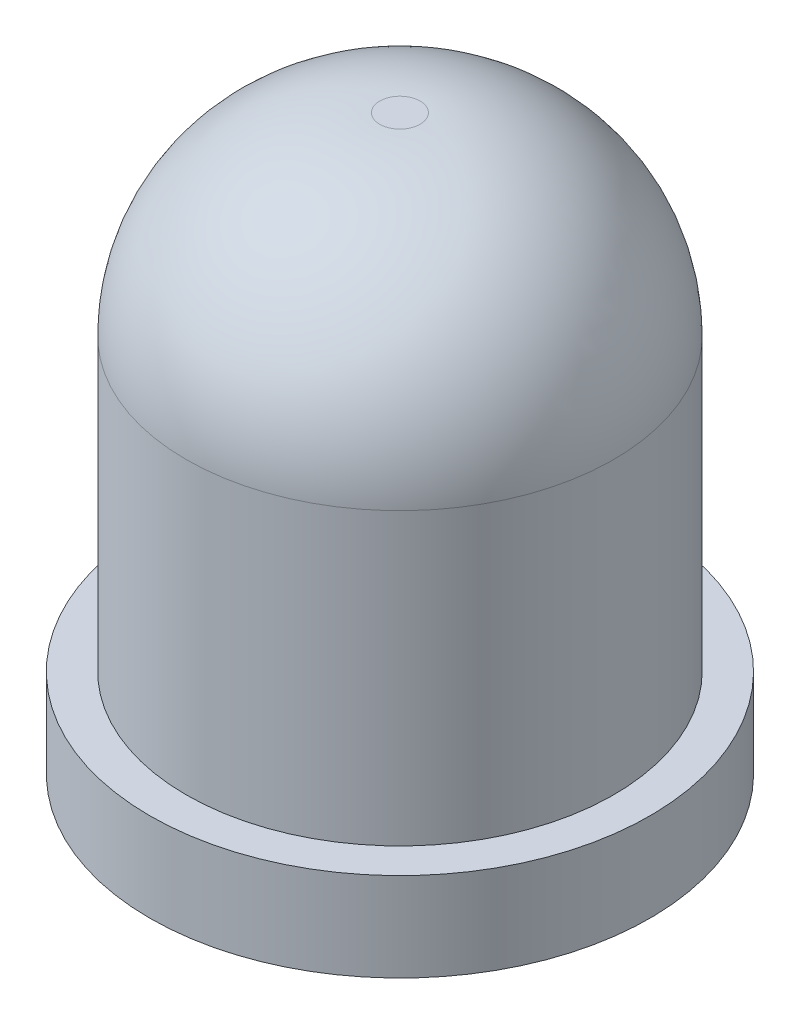
ISO-10303-21;
HEADER;
FILE_DESCRIPTION(('STEP AP214'),'2;1');
FILE_NAME('part.step','',(''),(''),'','','');
FILE_SCHEMA(('AUTOMOTIVE_DESIGN { 1 0 10303 214 1 1 1 1 }'));
ENDSEC;
DATA;
#1=APPLICATION_CONTEXT('core data for automotive mechanical design processes');
#2=APPLICATION_PROTOCOL_DEFINITION('international standard','automotive_design',2000,#1);
#3=PRODUCT_CONTEXT('',#1,'mechanical');
#4=PRODUCT('Part','Part','',(#3));
#5=PRODUCT_RELATED_PRODUCT_CATEGORY('part','',(#4));
#6=PRODUCT_DEFINITION_FORMATION('','',#4);
#7=PRODUCT_DEFINITION_CONTEXT('part definition',#1,'design');
#8=PRODUCT_DEFINITION('design','',#6,#7);
#9=PRODUCT_DEFINITION_SHAPE('','',#8);
#10=(LENGTH_UNIT() NAMED_UNIT(*) SI_UNIT(.MILLI.,.METRE.));
#11=(NAMED_UNIT(*) PLANE_ANGLE_UNIT() SI_UNIT($,.RADIAN.));
#12=(NAMED_UNIT(*) SI_UNIT($,.STERADIAN.) SOLID_ANGLE_UNIT());
#13=UNCERTAINTY_MEASURE_WITH_UNIT(LENGTH_MEASURE(1.E-05),#10,'distance_accuracy_value','');
#14=(GEOMETRIC_REPRESENTATION_CONTEXT(3) GLOBAL_UNCERTAINTY_ASSIGNED_CONTEXT((#13)) GLOBAL_UNIT_ASSIGNED_CONTEXT((#10,
#11,#12)) REPRESENTATION_CONTEXT('',''));
#15=CARTESIAN_POINT('',(0.,0.,0.));
#16=DIRECTION('',(0.,0.,1.));
#17=DIRECTION('',(1.,0.,0.));
#18=AXIS2_PLACEMENT_3D('',#15,#16,#17);
#19=CARTESIAN_POINT('',(0.,1.1,0.));
#20=DIRECTION('',(0.,1.,0.));
#21=DIRECTION('',(0.,0.,1.));
#22=AXIS2_PLACEMENT_3D('',#19,#20,#21);
#23=PLANE('',#22);
#24=CARTESIAN_POINT('',(0.,1.1,0.));
#25=DIRECTION('',(0.,1.,0.));
#26=DIRECTION('',(0.,0.,1.));
#27=AXIS2_PLACEMENT_3D('',#24,#25,#26);
#28=CIRCLE('',#27,3.1);
#29=CARTESIAN_POINT('',(0.,1.1,3.1));
#30=VERTEX_POINT('',#29);
#31=EDGE_CURVE('E40',#30,#30,#28,.T.);
#32=ORIENTED_EDGE('',*,*,#31,.T.);
#33=EDGE_LOOP('',(#32));
#34=FACE_BOUND('',#33,.T.);
#35=CARTESIAN_POINT('',(0.,1.1,0.));
#36=DIRECTION('',(0.,1.,0.));
#37=DIRECTION('',(0.,0.,1.));
#38=AXIS2_PLACEMENT_3D('',#35,#36,#37);
#39=CIRCLE('',#38,2.65);
#40=CARTESIAN_POINT('',(0.,1.1,2.65));
#41=VERTEX_POINT('',#40);
#42=EDGE_CURVE('E48',#41,#41,#39,.T.);
#43=ORIENTED_EDGE('',*,*,#42,.F.);
#44=EDGE_LOOP('',(#43));
#45=FACE_BOUND('',#44,.T.);
#46=ADVANCED_FACE('F29',(#34,#45),#23,.T.);
#47=CARTESIAN_POINT('',(0.,1.1,0.));
#48=DIRECTION('',(0.,-1.,0.));
#49=DIRECTION('',(0.,0.,-1.));
#50=AXIS2_PLACEMENT_3D('',#47,#48,#49);
#51=CYLINDRICAL_SURFACE('',#50,3.1);
#52=ORIENTED_EDGE('',*,*,#31,.F.);
#53=EDGE_LOOP('',(#52));
#54=FACE_BOUND('',#53,.T.);
#55=CARTESIAN_POINT('',(0.,0.,0.));
#56=DIRECTION('',(0.,1.,0.));
#57=DIRECTION('',(0.,0.,1.));
#58=AXIS2_PLACEMENT_3D('',#55,#56,#57);
#59=CIRCLE('',#58,3.1);
#60=CARTESIAN_POINT('',(0.,0.,3.1));
#61=VERTEX_POINT('',#60);
#62=EDGE_CURVE('E44',#61,#61,#59,.T.);
#63=ORIENTED_EDGE('',*,*,#62,.T.);
#64=EDGE_LOOP('',(#63));
#65=FACE_BOUND('',#64,.T.);
#66=ADVANCED_FACE('F56',(#54,#65),#51,.T.);
#67=CARTESIAN_POINT('',(0.,0.,0.));
#68=DIRECTION('',(0.,1.,0.));
#69=DIRECTION('',(0.,0.,1.));
#70=AXIS2_PLACEMENT_3D('',#67,#68,#69);
#71=PLANE('',#70);
#72=ORIENTED_EDGE('',*,*,#62,.F.);
#73=EDGE_LOOP('',(#72));
#74=FACE_BOUND('',#73,.T.);
#75=ADVANCED_FACE('F62',(#74),#71,.F.);
#76=CARTESIAN_POINT('',(0.,7.1,0.));
#77=DIRECTION('',(0.,-1.,0.));
#78=DIRECTION('',(0.,0.,-1.));
#79=AXIS2_PLACEMENT_3D('',#76,#77,#78);
#80=CYLINDRICAL_SURFACE('',#79,2.65);
#81=CARTESIAN_POINT('',(0.,4.7,0.));
#82=DIRECTION('',(0.,1.,0.));
#83=DIRECTION('',(0.,0.,1.));
#84=AXIS2_PLACEMENT_3D('',#81,#82,#83);
#85=CIRCLE('',#84,2.65);
#86=CARTESIAN_POINT('',(0.,4.7,2.65));
#87=VERTEX_POINT('',#86);
#88=EDGE_CURVE('E10',#87,#87,#85,.F.);
#89=ORIENTED_EDGE('',*,*,#88,.T.);
#90=EDGE_LOOP('',(#89));
#91=FACE_BOUND('',#90,.T.);
#92=ORIENTED_EDGE('',*,*,#42,.T.);
#93=EDGE_LOOP('',(#92));
#94=FACE_BOUND('',#93,.T.);
#95=ADVANCED_FACE('F53',(#91,#94),#80,.T.);
#96=CARTESIAN_POINT('',(0.,7.1,0.));
#97=DIRECTION('',(0.,1.,0.));
#98=DIRECTION('',(0.,0.,1.));
#99=AXIS2_PLACEMENT_3D('',#96,#97,#98);
#100=PLANE('',#99);
#101=CARTESIAN_POINT('',(0.,7.1,0.));
#102=DIRECTION('',(0.,1.,0.));
#103=DIRECTION('',(0.,0.,1.));
#104=AXIS2_PLACEMENT_3D('',#101,#102,#103);
#105=CIRCLE('',#104,0.25);
#106=CARTESIAN_POINT('',(0.,7.1,0.25));
#107=VERTEX_POINT('',#106);
#108=EDGE_CURVE('E36',#107,#107,#105,.T.);
#109=ORIENTED_EDGE('',*,*,#108,.T.);
#110=EDGE_LOOP('',(#109));
#111=FACE_BOUND('',#110,.T.);
#112=ADVANCED_FACE('F72',(#111),#100,.T.);
#113=CARTESIAN_POINT('',(0.,4.7,0.));
#114=DIRECTION('',(0.,1.,0.));
#115=DIRECTION('',(0.,0.,1.));
#116=AXIS2_PLACEMENT_3D('',#113,#114,#115);
#117=DEGENERATE_TOROIDAL_SURFACE('',#116,0.25,2.4,.T.);
#118=ORIENTED_EDGE('',*,*,#88,.F.);
#119=EDGE_LOOP('',(#118));
#120=FACE_BOUND('',#119,.T.);
#121=ORIENTED_EDGE('',*,*,#108,.F.);
#122=EDGE_LOOP('',(#121));
#123=FACE_BOUND('',#122,.T.);
#124=ADVANCED_FACE('F31',(#120,#123),#117,.T.);
#125=CLOSED_SHELL('',(#46,#66,#75,#95,#112,#124));
#126=MANIFOLD_SOLID_BREP('B2',#125);
#127=ADVANCED_BREP_SHAPE_REPRESENTATION('',(#18,#126),#14);
#128=SHAPE_DEFINITION_REPRESENTATION(#9,#127);
ENDSEC;
END-ISO-10303-21;
